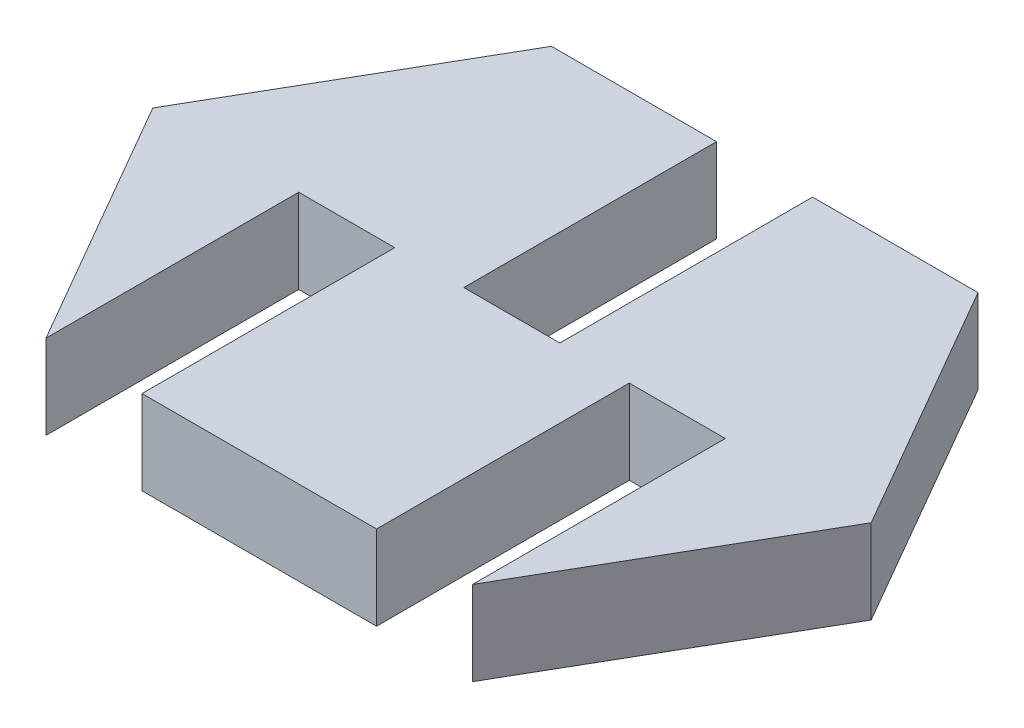
ISO-10303-21;
HEADER;
FILE_DESCRIPTION(('STEP AP214'),'2;1');
FILE_NAME('part.step','',(''),(''),'','','');
FILE_SCHEMA(('AUTOMOTIVE_DESIGN { 1 0 10303 214 1 1 1 1 }'));
ENDSEC;
DATA;
#1=APPLICATION_CONTEXT('core data for automotive mechanical design processes');
#2=APPLICATION_PROTOCOL_DEFINITION('international standard','automotive_design',2000,#1);
#3=PRODUCT_CONTEXT('',#1,'mechanical');
#4=PRODUCT('Part','Part','',(#3));
#5=PRODUCT_RELATED_PRODUCT_CATEGORY('part','',(#4));
#6=PRODUCT_DEFINITION_FORMATION('','',#4);
#7=PRODUCT_DEFINITION_CONTEXT('part definition',#1,'design');
#8=PRODUCT_DEFINITION('design','',#6,#7);
#9=PRODUCT_DEFINITION_SHAPE('','',#8);
#10=(LENGTH_UNIT() NAMED_UNIT(*) SI_UNIT(.MILLI.,.METRE.));
#11=(NAMED_UNIT(*) PLANE_ANGLE_UNIT() SI_UNIT($,.RADIAN.));
#12=(NAMED_UNIT(*) SI_UNIT($,.STERADIAN.) SOLID_ANGLE_UNIT());
#13=UNCERTAINTY_MEASURE_WITH_UNIT(LENGTH_MEASURE(1.E-05),#10,'distance_accuracy_value','');
#14=(GEOMETRIC_REPRESENTATION_CONTEXT(3) GLOBAL_UNCERTAINTY_ASSIGNED_CONTEXT((#13)) GLOBAL_UNIT_ASSIGNED_CONTEXT((#10,
#11,#12)) REPRESENTATION_CONTEXT('',''));
#15=CARTESIAN_POINT('',(0.,0.,0.));
#16=DIRECTION('',(0.,0.,1.));
#17=DIRECTION('',(1.,0.,0.));
#18=AXIS2_PLACEMENT_3D('',#15,#16,#17);
#19=CARTESIAN_POINT('',(4.2511833424019,2.5,-7.49062495930957));
#20=DIRECTION('',(0.,0.,1.));
#21=DIRECTION('',(1.,0.,0.));
#22=AXIS2_PLACEMENT_3D('',#19,#20,#21);
#23=PLANE('',#22);
#24=DIRECTION('',(-1.,0.,0.));
#25=VECTOR('',#24,1.);
#26=CARTESIAN_POINT('',(4.2511833424019,0.,-7.49062495930957));
#27=LINE('',#26,#25);
#28=CARTESIAN_POINT('',(4.2511833424019,0.,-7.49062495930957));
#29=VERTEX_POINT('',#28);
#30=CARTESIAN_POINT('',(-0.658816657598096,0.,-7.49062495930957));
#31=VERTEX_POINT('',#30);
#32=EDGE_CURVE('E279',#29,#31,#27,.T.);
#33=ORIENTED_EDGE('',*,*,#32,.T.);
#34=DIRECTION('',(0.,-1.,0.));
#35=VECTOR('',#34,1.);
#36=CARTESIAN_POINT('',(-0.658816657598096,2.5,-7.49062495930957));
#37=LINE('',#36,#35);
#38=CARTESIAN_POINT('',(-0.658816657598096,2.5,-7.49062495930957));
#39=VERTEX_POINT('',#38);
#40=EDGE_CURVE('E317',#39,#31,#37,.T.);
#41=ORIENTED_EDGE('',*,*,#40,.F.);
#42=DIRECTION('',(-1.,0.,0.));
#43=VECTOR('',#42,1.);
#44=CARTESIAN_POINT('',(4.2511833424019,2.5,-7.49062495930957));
#45=LINE('',#44,#43);
#46=CARTESIAN_POINT('',(4.2511833424019,2.5,-7.49062495930957));
#47=VERTEX_POINT('',#46);
#48=EDGE_CURVE('E257',#47,#39,#45,.T.);
#49=ORIENTED_EDGE('',*,*,#48,.F.);
#50=DIRECTION('',(0.,-1.,0.));
#51=VECTOR('',#50,1.);
#52=CARTESIAN_POINT('',(4.2511833424019,2.5,-7.49062495930957));
#53=LINE('',#52,#51);
#54=EDGE_CURVE('E48',#47,#29,#53,.T.);
#55=ORIENTED_EDGE('',*,*,#54,.T.);
#56=EDGE_LOOP('',(#33,#41,#49,#55));
#57=FACE_BOUND('',#56,.T.);
#58=ADVANCED_FACE('F39',(#57),#23,.F.);
#59=CARTESIAN_POINT('',(4.25118334240191,2.5,7.50937504069043));
#60=DIRECTION('',(-0.866025403784438,0.,-0.5));
#61=DIRECTION('',(-0.5,0.,0.866025403784438));
#62=AXIS2_PLACEMENT_3D('',#59,#60,#61);
#63=PLANE('',#62);
#64=DIRECTION('',(0.5,0.,-0.866025403784438));
#65=VECTOR('',#64,1.);
#66=CARTESIAN_POINT('',(4.25118334240191,0.,7.50937504069043));
#67=LINE('',#66,#65);
#68=CARTESIAN_POINT('',(4.25118334240191,0.,7.50937504069043));
#69=VERTEX_POINT('',#68);
#70=CARTESIAN_POINT('',(8.58131036132411,0.,0.00937504069043324));
#71=VERTEX_POINT('',#70);
#72=EDGE_CURVE('E237',#69,#71,#67,.T.);
#73=ORIENTED_EDGE('',*,*,#72,.T.);
#74=DIRECTION('',(0.,-1.,0.));
#75=VECTOR('',#74,1.);
#76=CARTESIAN_POINT('',(8.58131036132411,2.5,0.00937504069043324));
#77=LINE('',#76,#75);
#78=CARTESIAN_POINT('',(8.58131036132411,2.5,0.00937504069043324));
#79=VERTEX_POINT('',#78);
#80=EDGE_CURVE('E11',#79,#71,#77,.T.);
#81=ORIENTED_EDGE('',*,*,#80,.F.);
#82=DIRECTION('',(0.5,0.,-0.866025403784438));
#83=VECTOR('',#82,1.);
#84=CARTESIAN_POINT('',(4.25118334240191,2.5,7.50937504069043));
#85=LINE('',#84,#83);
#86=CARTESIAN_POINT('',(4.25118334240191,2.5,7.50937504069043));
#87=VERTEX_POINT('',#86);
#88=EDGE_CURVE('E248',#87,#79,#85,.T.);
#89=ORIENTED_EDGE('',*,*,#88,.F.);
#90=DIRECTION('',(0.,-1.,0.));
#91=VECTOR('',#90,1.);
#92=CARTESIAN_POINT('',(4.25118334240191,2.5,7.50937504069043));
#93=LINE('',#92,#91);
#94=EDGE_CURVE('E272',#87,#69,#93,.T.);
#95=ORIENTED_EDGE('',*,*,#94,.T.);
#96=EDGE_LOOP('',(#73,#81,#89,#95));
#97=FACE_BOUND('',#96,.T.);
#98=ADVANCED_FACE('F41',(#97),#63,.F.);
#99=CARTESIAN_POINT('',(8.58131036132411,2.5,0.00937504069043324));
#100=DIRECTION('',(-0.866025403784438,0.,0.5));
#101=DIRECTION('',(0.5,0.,0.866025403784438));
#102=AXIS2_PLACEMENT_3D('',#99,#100,#101);
#103=PLANE('',#102);
#104=DIRECTION('',(-0.5,0.,-0.866025403784438));
#105=VECTOR('',#104,1.);
#106=CARTESIAN_POINT('',(8.58131036132411,0.,0.00937504069043324));
#107=LINE('',#106,#105);
#108=EDGE_CURVE('E276',#71,#29,#107,.T.);
#109=ORIENTED_EDGE('',*,*,#108,.T.);
#110=ORIENTED_EDGE('',*,*,#54,.F.);
#111=DIRECTION('',(-0.5,0.,-0.866025403784438));
#112=VECTOR('',#111,1.);
#113=CARTESIAN_POINT('',(8.58131036132411,2.5,0.00937504069043324));
#114=LINE('',#113,#112);
#115=EDGE_CURVE('E252',#79,#47,#114,.T.);
#116=ORIENTED_EDGE('',*,*,#115,.F.);
#117=ORIENTED_EDGE('',*,*,#80,.T.);
#118=EDGE_LOOP('',(#109,#110,#116,#117));
#119=FACE_BOUND('',#118,.T.);
#120=ADVANCED_FACE('F371',(#119),#103,.F.);
#121=CARTESIAN_POINT('',(-3.5088166575981,2.5,-7.49062495930957));
#122=VERTEX_POINT('',#121);
#123=CARTESIAN_POINT('',(-8.40907069544247,2.5,-7.49062495930957));
#124=VERTEX_POINT('',#123);
#125=EDGE_CURVE('E256',#122,#124,#45,.T.);
#126=ORIENTED_EDGE('',*,*,#125,.F.);
#127=DIRECTION('',(0.,1.,0.));
#128=VECTOR('',#127,1.);
#129=CARTESIAN_POINT('',(-3.5088166575981,2.5,-7.49062495930957));
#130=LINE('',#129,#128);
#131=CARTESIAN_POINT('',(-3.5088166575981,0.,-7.49062495930957));
#132=VERTEX_POINT('',#131);
#133=EDGE_CURVE('E320',#132,#122,#130,.T.);
#134=ORIENTED_EDGE('',*,*,#133,.F.);
#135=CARTESIAN_POINT('',(-8.40907069544247,0.,-7.49062495930957));
#136=VERTEX_POINT('',#135);
#137=EDGE_CURVE('E175',#132,#136,#27,.T.);
#138=ORIENTED_EDGE('',*,*,#137,.T.);
#139=DIRECTION('',(0.,-1.,0.));
#140=VECTOR('',#139,1.);
#141=CARTESIAN_POINT('',(-8.40907069544247,2.5,-7.49062495930957));
#142=LINE('',#141,#140);
#143=EDGE_CURVE('E303',#124,#136,#142,.T.);
#144=ORIENTED_EDGE('',*,*,#143,.F.);
#145=EDGE_LOOP('',(#126,#134,#138,#144));
#146=FACE_BOUND('',#145,.T.);
#147=ADVANCED_FACE('F335',(#146),#23,.F.);
#148=CARTESIAN_POINT('',(-8.40907069544247,2.5,-7.49062495930957));
#149=DIRECTION('',(0.866025403784439,0.,0.5));
#150=DIRECTION('',(0.5,0.,-0.866025403784439));
#151=AXIS2_PLACEMENT_3D('',#148,#149,#150);
#152=PLANE('',#151);
#153=DIRECTION('',(-0.5,0.,0.866025403784439));
#154=VECTOR('',#153,1.);
#155=CARTESIAN_POINT('',(-8.40907069544247,0.,-7.49062495930957));
#156=LINE('',#155,#154);
#157=CARTESIAN_POINT('',(-12.7391977143647,0.,0.00937504069042916));
#158=VERTEX_POINT('',#157);
#159=EDGE_CURVE('E283',#136,#158,#156,.T.);
#160=ORIENTED_EDGE('',*,*,#159,.T.);
#161=DIRECTION('',(0.,-1.,0.));
#162=VECTOR('',#161,1.);
#163=CARTESIAN_POINT('',(-12.7391977143647,2.5,0.00937504069042916));
#164=LINE('',#163,#162);
#165=CARTESIAN_POINT('',(-12.7391977143647,2.5,0.00937504069042916));
#166=VERTEX_POINT('',#165);
#167=EDGE_CURVE('E299',#166,#158,#164,.T.);
#168=ORIENTED_EDGE('',*,*,#167,.F.);
#169=DIRECTION('',(-0.5,0.,0.866025403784439));
#170=VECTOR('',#169,1.);
#171=CARTESIAN_POINT('',(-8.40907069544247,2.5,-7.49062495930957));
#172=LINE('',#171,#170);
#173=EDGE_CURVE('E261',#124,#166,#172,.T.);
#174=ORIENTED_EDGE('',*,*,#173,.F.);
#175=ORIENTED_EDGE('',*,*,#143,.T.);
#176=EDGE_LOOP('',(#160,#168,#174,#175));
#177=FACE_BOUND('',#176,.T.);
#178=ADVANCED_FACE('F337',(#177),#152,.F.);
#179=CARTESIAN_POINT('',(-12.7391977143647,2.5,0.00937504069042916));
#180=DIRECTION('',(0.866025403784439,0.,-0.5));
#181=DIRECTION('',(-0.5,0.,-0.866025403784439));
#182=AXIS2_PLACEMENT_3D('',#179,#180,#181);
#183=PLANE('',#182);
#184=DIRECTION('',(0.5,0.,0.866025403784439));
#185=VECTOR('',#184,1.);
#186=CARTESIAN_POINT('',(-12.7391977143647,0.,0.00937504069042916));
#187=LINE('',#186,#185);
#188=CARTESIAN_POINT('',(-8.40907069544247,0.,7.50937504069043));
#189=VERTEX_POINT('',#188);
#190=EDGE_CURVE('E286',#158,#189,#187,.T.);
#191=ORIENTED_EDGE('',*,*,#190,.T.);
#192=DIRECTION('',(0.,-1.,0.));
#193=VECTOR('',#192,1.);
#194=CARTESIAN_POINT('',(-8.40907069544247,2.5,7.50937504069043));
#195=LINE('',#194,#193);
#196=CARTESIAN_POINT('',(-8.40907069544247,2.5,7.50937504069043));
#197=VERTEX_POINT('',#196);
#198=EDGE_CURVE('E296',#197,#189,#195,.T.);
#199=ORIENTED_EDGE('',*,*,#198,.F.);
#200=DIRECTION('',(0.5,0.,0.866025403784439));
#201=VECTOR('',#200,1.);
#202=CARTESIAN_POINT('',(-12.7391977143647,2.5,0.00937504069042916));
#203=LINE('',#202,#201);
#204=EDGE_CURVE('E264',#166,#197,#203,.T.);
#205=ORIENTED_EDGE('',*,*,#204,.F.);
#206=ORIENTED_EDGE('',*,*,#167,.T.);
#207=EDGE_LOOP('',(#191,#199,#205,#206));
#208=FACE_BOUND('',#207,.T.);
#209=ADVANCED_FACE('F342',(#208),#183,.F.);
#210=CARTESIAN_POINT('',(-8.40907069544247,2.5,7.50937504069043));
#211=DIRECTION('',(0.,0.,-1.));
#212=DIRECTION('',(-1.,0.,0.));
#213=AXIS2_PLACEMENT_3D('',#210,#211,#212);
#214=PLANE('',#213);
#215=DIRECTION('',(1.,0.,0.));
#216=VECTOR('',#215,1.);
#217=CARTESIAN_POINT('',(-8.40907069544247,0.,7.50937504069043));
#218=LINE('',#217,#216);
#219=CARTESIAN_POINT('',(-5.55907069544248,0.,7.50937504069043));
#220=VERTEX_POINT('',#219);
#221=CARTESIAN_POINT('',(1.40118334240191,0.,7.50937504069043));
#222=VERTEX_POINT('',#221);
#223=EDGE_CURVE('E253',#220,#222,#218,.T.);
#224=ORIENTED_EDGE('',*,*,#223,.T.);
#225=DIRECTION('',(0.,-1.,0.));
#226=VECTOR('',#225,1.);
#227=CARTESIAN_POINT('',(1.40118334240191,0.,7.50937504069043));
#228=LINE('',#227,#226);
#229=CARTESIAN_POINT('',(1.40118334240191,2.5,7.50937504069043));
#230=VERTEX_POINT('',#229);
#231=EDGE_CURVE('E191',#230,#222,#228,.T.);
#232=ORIENTED_EDGE('',*,*,#231,.F.);
#233=DIRECTION('',(1.,0.,0.));
#234=VECTOR('',#233,1.);
#235=CARTESIAN_POINT('',(-8.40907069544247,2.5,7.50937504069043));
#236=LINE('',#235,#234);
#237=CARTESIAN_POINT('',(-5.55907069544248,2.5,7.50937504069043));
#238=VERTEX_POINT('',#237);
#239=EDGE_CURVE('E268',#238,#230,#236,.T.);
#240=ORIENTED_EDGE('',*,*,#239,.F.);
#241=DIRECTION('',(0.,1.,0.));
#242=VECTOR('',#241,1.);
#243=CARTESIAN_POINT('',(-5.55907069544248,0.,7.50937504069043));
#244=LINE('',#243,#242);
#245=EDGE_CURVE('E205',#220,#238,#244,.T.);
#246=ORIENTED_EDGE('',*,*,#245,.F.);
#247=EDGE_LOOP('',(#224,#232,#240,#246));
#248=FACE_BOUND('',#247,.T.);
#249=ADVANCED_FACE('F359',(#248),#214,.F.);
#250=CARTESIAN_POINT('',(0.,2.5,0.));
#251=DIRECTION('',(0.,1.,0.));
#252=DIRECTION('',(0.,0.,1.));
#253=AXIS2_PLACEMENT_3D('',#250,#251,#252);
#254=PLANE('',#253);
#255=DIRECTION('',(0.,0.,-1.));
#256=VECTOR('',#255,1.);
#257=CARTESIAN_POINT('',(-0.658816657598096,2.5,0.00937504069042742));
#258=LINE('',#257,#256);
#259=CARTESIAN_POINT('',(-0.658816657598096,2.5,0.00937504069042742));
#260=VERTEX_POINT('',#259);
#261=EDGE_CURVE('E181',#260,#39,#258,.T.);
#262=ORIENTED_EDGE('',*,*,#261,.F.);
#263=DIRECTION('',(1.,0.,0.));
#264=VECTOR('',#263,1.);
#265=CARTESIAN_POINT('',(-0.658816657598096,2.5,0.00937504069042742));
#266=LINE('',#265,#264);
#267=CARTESIAN_POINT('',(-3.5088166575981,2.5,0.00937504069042742));
#268=VERTEX_POINT('',#267);
#269=EDGE_CURVE('E163',#268,#260,#266,.T.);
#270=ORIENTED_EDGE('',*,*,#269,.F.);
#271=DIRECTION('',(0.,0.,-1.));
#272=VECTOR('',#271,1.);
#273=CARTESIAN_POINT('',(-3.5088166575981,2.5,0.00937504069042742));
#274=LINE('',#273,#272);
#275=EDGE_CURVE('E160',#268,#122,#274,.T.);
#276=ORIENTED_EDGE('',*,*,#275,.T.);
#277=ORIENTED_EDGE('',*,*,#125,.T.);
#278=ORIENTED_EDGE('',*,*,#173,.T.);
#279=ORIENTED_EDGE('',*,*,#204,.T.);
#280=DIRECTION('',(0.,0.,1.));
#281=VECTOR('',#280,1.);
#282=CARTESIAN_POINT('',(-8.40907069544247,2.5,0.00937504069042829));
#283=LINE('',#282,#281);
#284=CARTESIAN_POINT('',(-8.40907069544247,2.5,0.00937504069042829));
#285=VERTEX_POINT('',#284);
#286=EDGE_CURVE('E234',#285,#197,#283,.T.);
#287=ORIENTED_EDGE('',*,*,#286,.F.);
#288=DIRECTION('',(-1.,0.,0.));
#289=VECTOR('',#288,1.);
#290=CARTESIAN_POINT('',(-8.40907069544247,2.5,0.00937504069042829));
#291=LINE('',#290,#289);
#292=CARTESIAN_POINT('',(-5.55907069544248,2.5,0.00937504069042829));
#293=VERTEX_POINT('',#292);
#294=EDGE_CURVE('E227',#293,#285,#291,.T.);
#295=ORIENTED_EDGE('',*,*,#294,.F.);
#296=DIRECTION('',(0.,0.,1.));
#297=VECTOR('',#296,1.);
#298=CARTESIAN_POINT('',(-5.55907069544248,2.5,0.00937504069042829));
#299=LINE('',#298,#297);
#300=EDGE_CURVE('E238',#293,#238,#299,.T.);
#301=ORIENTED_EDGE('',*,*,#300,.T.);
#302=ORIENTED_EDGE('',*,*,#239,.T.);
#303=DIRECTION('',(0.,0.,1.));
#304=VECTOR('',#303,1.);
#305=CARTESIAN_POINT('',(1.40118334240191,2.5,0.00937504069042829));
#306=LINE('',#305,#304);
#307=CARTESIAN_POINT('',(1.40118334240191,2.5,0.00937504069042829));
#308=VERTEX_POINT('',#307);
#309=EDGE_CURVE('E210',#308,#230,#306,.T.);
#310=ORIENTED_EDGE('',*,*,#309,.F.);
#311=DIRECTION('',(-1.,0.,0.));
#312=VECTOR('',#311,1.);
#313=CARTESIAN_POINT('',(4.25118334240191,2.5,0.00937504069042829));
#314=LINE('',#313,#312);
#315=CARTESIAN_POINT('',(4.25118334240191,2.5,0.00937504069042829));
#316=VERTEX_POINT('',#315);
#317=EDGE_CURVE('E190',#316,#308,#314,.T.);
#318=ORIENTED_EDGE('',*,*,#317,.F.);
#319=DIRECTION('',(0.,0.,1.));
#320=VECTOR('',#319,1.);
#321=CARTESIAN_POINT('',(4.25118334240191,2.5,0.00937504069042829));
#322=LINE('',#321,#320);
#323=EDGE_CURVE('E199',#316,#87,#322,.T.);
#324=ORIENTED_EDGE('',*,*,#323,.T.);
#325=ORIENTED_EDGE('',*,*,#88,.T.);
#326=ORIENTED_EDGE('',*,*,#115,.T.);
#327=ORIENTED_EDGE('',*,*,#48,.T.);
#328=EDGE_LOOP('',(#262,#270,#276,#277,#278,#279,#287,#295,#301,#302,#310,#318,#324,#325,#326,#327));
#329=FACE_BOUND('',#328,.T.);
#330=ADVANCED_FACE('F331',(#329),#254,.T.);
#331=CARTESIAN_POINT('',(0.,0.,0.));
#332=DIRECTION('',(0.,1.,0.));
#333=DIRECTION('',(0.,0.,1.));
#334=AXIS2_PLACEMENT_3D('',#331,#332,#333);
#335=PLANE('',#334);
#336=DIRECTION('',(-1.,0.,0.));
#337=VECTOR('',#336,1.);
#338=CARTESIAN_POINT('',(-0.658816657598096,0.,0.00937504069042742));
#339=LINE('',#338,#337);
#340=CARTESIAN_POINT('',(-0.658816657598096,0.,0.00937504069042742));
#341=VERTEX_POINT('',#340);
#342=CARTESIAN_POINT('',(-3.5088166575981,0.,0.00937504069042742));
#343=VERTEX_POINT('',#342);
#344=EDGE_CURVE('E164',#341,#343,#339,.T.);
#345=ORIENTED_EDGE('',*,*,#344,.F.);
#346=DIRECTION('',(0.,0.,-1.));
#347=VECTOR('',#346,1.);
#348=CARTESIAN_POINT('',(-0.658816657598096,0.,0.00937504069042742));
#349=LINE('',#348,#347);
#350=EDGE_CURVE('E177',#341,#31,#349,.T.);
#351=ORIENTED_EDGE('',*,*,#350,.T.);
#352=ORIENTED_EDGE('',*,*,#32,.F.);
#353=ORIENTED_EDGE('',*,*,#108,.F.);
#354=ORIENTED_EDGE('',*,*,#72,.F.);
#355=DIRECTION('',(0.,0.,1.));
#356=VECTOR('',#355,1.);
#357=CARTESIAN_POINT('',(4.25118334240191,0.,0.00937504069042829));
#358=LINE('',#357,#356);
#359=CARTESIAN_POINT('',(4.25118334240191,0.,0.00937504069042829));
#360=VERTEX_POINT('',#359);
#361=EDGE_CURVE('E202',#360,#69,#358,.T.);
#362=ORIENTED_EDGE('',*,*,#361,.F.);
#363=DIRECTION('',(1.,0.,0.));
#364=VECTOR('',#363,1.);
#365=CARTESIAN_POINT('',(4.25118334240191,0.,0.00937504069042829));
#366=LINE('',#365,#364);
#367=CARTESIAN_POINT('',(1.40118334240191,0.,0.00937504069042829));
#368=VERTEX_POINT('',#367);
#369=EDGE_CURVE('E196',#368,#360,#366,.T.);
#370=ORIENTED_EDGE('',*,*,#369,.F.);
#371=DIRECTION('',(0.,0.,1.));
#372=VECTOR('',#371,1.);
#373=CARTESIAN_POINT('',(1.40118334240191,0.,0.00937504069042829));
#374=LINE('',#373,#372);
#375=EDGE_CURVE('E206',#368,#222,#374,.T.);
#376=ORIENTED_EDGE('',*,*,#375,.T.);
#377=ORIENTED_EDGE('',*,*,#223,.F.);
#378=DIRECTION('',(0.,0.,1.));
#379=VECTOR('',#378,1.);
#380=CARTESIAN_POINT('',(-5.55907069544248,0.,0.00937504069042829));
#381=LINE('',#380,#379);
#382=CARTESIAN_POINT('',(-5.55907069544248,0.,0.00937504069042829));
#383=VERTEX_POINT('',#382);
#384=EDGE_CURVE('E242',#383,#220,#381,.T.);
#385=ORIENTED_EDGE('',*,*,#384,.F.);
#386=DIRECTION('',(1.,0.,0.));
#387=VECTOR('',#386,1.);
#388=CARTESIAN_POINT('',(-8.40907069544247,0.,0.00937504069042829));
#389=LINE('',#388,#387);
#390=CARTESIAN_POINT('',(-8.40907069544247,0.,0.00937504069042829));
#391=VERTEX_POINT('',#390);
#392=EDGE_CURVE('E219',#391,#383,#389,.T.);
#393=ORIENTED_EDGE('',*,*,#392,.F.);
#394=DIRECTION('',(0.,0.,1.));
#395=VECTOR('',#394,1.);
#396=CARTESIAN_POINT('',(-8.40907069544247,0.,0.00937504069042829));
#397=LINE('',#396,#395);
#398=EDGE_CURVE('E231',#391,#189,#397,.T.);
#399=ORIENTED_EDGE('',*,*,#398,.T.);
#400=ORIENTED_EDGE('',*,*,#190,.F.);
#401=ORIENTED_EDGE('',*,*,#159,.F.);
#402=ORIENTED_EDGE('',*,*,#137,.F.);
#403=DIRECTION('',(0.,0.,-1.));
#404=VECTOR('',#403,1.);
#405=CARTESIAN_POINT('',(-3.5088166575981,0.,0.00937504069042742));
#406=LINE('',#405,#404);
#407=EDGE_CURVE('E157',#343,#132,#406,.T.);
#408=ORIENTED_EDGE('',*,*,#407,.F.);
#409=EDGE_LOOP('',(#345,#351,#352,#353,#354,#362,#370,#376,#377,#385,#393,#399,#400,#401,#402,#408));
#410=FACE_BOUND('',#409,.T.);
#411=ADVANCED_FACE('F173',(#410),#335,.F.);
#412=CARTESIAN_POINT('',(-8.40907069544247,0.,0.00937504069042829));
#413=DIRECTION('',(-1.,0.,0.));
#414=DIRECTION('',(0.,0.,1.));
#415=AXIS2_PLACEMENT_3D('',#412,#413,#414);
#416=PLANE('',#415);
#417=ORIENTED_EDGE('',*,*,#198,.T.);
#418=ORIENTED_EDGE('',*,*,#398,.F.);
#419=DIRECTION('',(0.,-1.,0.));
#420=VECTOR('',#419,1.);
#421=CARTESIAN_POINT('',(-8.40907069544247,0.,0.00937504069042829));
#422=LINE('',#421,#420);
#423=EDGE_CURVE('E216',#285,#391,#422,.T.);
#424=ORIENTED_EDGE('',*,*,#423,.F.);
#425=ORIENTED_EDGE('',*,*,#286,.T.);
#426=EDGE_LOOP('',(#417,#418,#424,#425));
#427=FACE_BOUND('',#426,.T.);
#428=ADVANCED_FACE('F346',(#427),#416,.F.);
#429=CARTESIAN_POINT('',(-5.55907069544248,0.,0.00937504069042829));
#430=DIRECTION('',(1.,0.,0.));
#431=DIRECTION('',(0.,0.,-1.));
#432=AXIS2_PLACEMENT_3D('',#429,#430,#431);
#433=PLANE('',#432);
#434=ORIENTED_EDGE('',*,*,#245,.T.);
#435=ORIENTED_EDGE('',*,*,#300,.F.);
#436=DIRECTION('',(0.,1.,0.));
#437=VECTOR('',#436,1.);
#438=CARTESIAN_POINT('',(-5.55907069544248,0.,0.00937504069042829));
#439=LINE('',#438,#437);
#440=EDGE_CURVE('E223',#383,#293,#439,.T.);
#441=ORIENTED_EDGE('',*,*,#440,.F.);
#442=ORIENTED_EDGE('',*,*,#384,.T.);
#443=EDGE_LOOP('',(#434,#435,#441,#442));
#444=FACE_BOUND('',#443,.T.);
#445=ADVANCED_FACE('F353',(#444),#433,.F.);
#446=CARTESIAN_POINT('',(0.,0.,0.00937504069042829));
#447=DIRECTION('',(0.,0.,-1.));
#448=DIRECTION('',(-1.,0.,0.));
#449=AXIS2_PLACEMENT_3D('',#446,#447,#448);
#450=PLANE('',#449);
#451=ORIENTED_EDGE('',*,*,#423,.T.);
#452=ORIENTED_EDGE('',*,*,#392,.T.);
#453=ORIENTED_EDGE('',*,*,#440,.T.);
#454=ORIENTED_EDGE('',*,*,#294,.T.);
#455=EDGE_LOOP('',(#451,#452,#453,#454));
#456=FACE_BOUND('',#455,.T.);
#457=ADVANCED_FACE('F350',(#456),#450,.F.);
#458=CARTESIAN_POINT('',(4.25118334240191,0.,0.00937504069042829));
#459=DIRECTION('',(1.,0.,0.));
#460=DIRECTION('',(0.,0.,-1.));
#461=AXIS2_PLACEMENT_3D('',#458,#459,#460);
#462=PLANE('',#461);
#463=ORIENTED_EDGE('',*,*,#94,.F.);
#464=ORIENTED_EDGE('',*,*,#323,.F.);
#465=DIRECTION('',(0.,1.,0.));
#466=VECTOR('',#465,1.);
#467=CARTESIAN_POINT('',(4.25118334240191,0.,0.00937504069042829));
#468=LINE('',#467,#466);
#469=EDGE_CURVE('E186',#360,#316,#468,.T.);
#470=ORIENTED_EDGE('',*,*,#469,.F.);
#471=ORIENTED_EDGE('',*,*,#361,.T.);
#472=EDGE_LOOP('',(#463,#464,#470,#471));
#473=FACE_BOUND('',#472,.T.);
#474=ADVANCED_FACE('F401',(#473),#462,.F.);
#475=CARTESIAN_POINT('',(1.40118334240191,0.,0.00937504069042829));
#476=DIRECTION('',(-1.,0.,0.));
#477=DIRECTION('',(0.,0.,1.));
#478=AXIS2_PLACEMENT_3D('',#475,#476,#477);
#479=PLANE('',#478);
#480=ORIENTED_EDGE('',*,*,#231,.T.);
#481=ORIENTED_EDGE('',*,*,#375,.F.);
#482=DIRECTION('',(0.,-1.,0.));
#483=VECTOR('',#482,1.);
#484=CARTESIAN_POINT('',(1.40118334240191,0.,0.00937504069042829));
#485=LINE('',#484,#483);
#486=EDGE_CURVE('E63',#308,#368,#485,.T.);
#487=ORIENTED_EDGE('',*,*,#486,.F.);
#488=ORIENTED_EDGE('',*,*,#309,.T.);
#489=EDGE_LOOP('',(#480,#481,#487,#488));
#490=FACE_BOUND('',#489,.T.);
#491=ADVANCED_FACE('F362',(#490),#479,.F.);
#492=CARTESIAN_POINT('',(0.,0.,0.00937504069042829));
#493=DIRECTION('',(0.,0.,1.));
#494=DIRECTION('',(1.,0.,0.));
#495=AXIS2_PLACEMENT_3D('',#492,#493,#494);
#496=PLANE('',#495);
#497=ORIENTED_EDGE('',*,*,#469,.T.);
#498=ORIENTED_EDGE('',*,*,#317,.T.);
#499=ORIENTED_EDGE('',*,*,#486,.T.);
#500=ORIENTED_EDGE('',*,*,#369,.T.);
#501=EDGE_LOOP('',(#497,#498,#499,#500));
#502=FACE_BOUND('',#501,.T.);
#503=ADVANCED_FACE('F365',(#502),#496,.T.);
#504=CARTESIAN_POINT('',(-0.658816657598096,2.5,0.00937504069042742));
#505=DIRECTION('',(1.,0.,0.));
#506=DIRECTION('',(0.,1.,0.));
#507=AXIS2_PLACEMENT_3D('',#504,#505,#506);
#508=PLANE('',#507);
#509=ORIENTED_EDGE('',*,*,#40,.T.);
#510=ORIENTED_EDGE('',*,*,#350,.F.);
#511=DIRECTION('',(0.,-1.,0.));
#512=VECTOR('',#511,1.);
#513=CARTESIAN_POINT('',(-0.658816657598096,2.5,0.00937504069042742));
#514=LINE('',#513,#512);
#515=EDGE_CURVE('E55',#260,#341,#514,.T.);
#516=ORIENTED_EDGE('',*,*,#515,.F.);
#517=ORIENTED_EDGE('',*,*,#261,.T.);
#518=EDGE_LOOP('',(#509,#510,#516,#517));
#519=FACE_BOUND('',#518,.T.);
#520=ADVANCED_FACE('F316',(#519),#508,.F.);
#521=CARTESIAN_POINT('',(-3.5088166575981,2.5,0.00937504069042742));
#522=DIRECTION('',(-1.,0.,0.));
#523=DIRECTION('',(0.,0.,1.));
#524=AXIS2_PLACEMENT_3D('',#521,#522,#523);
#525=PLANE('',#524);
#526=ORIENTED_EDGE('',*,*,#133,.T.);
#527=ORIENTED_EDGE('',*,*,#275,.F.);
#528=DIRECTION('',(0.,1.,0.));
#529=VECTOR('',#528,1.);
#530=CARTESIAN_POINT('',(-3.5088166575981,2.5,0.00937504069042742));
#531=LINE('',#530,#529);
#532=EDGE_CURVE('E154',#343,#268,#531,.T.);
#533=ORIENTED_EDGE('',*,*,#532,.F.);
#534=ORIENTED_EDGE('',*,*,#407,.T.);
#535=EDGE_LOOP('',(#526,#527,#533,#534));
#536=FACE_BOUND('',#535,.T.);
#537=ADVANCED_FACE('F155',(#536),#525,.F.);
#538=CARTESIAN_POINT('',(0.,0.,0.00937504069042742));
#539=DIRECTION('',(0.,0.,-1.));
#540=DIRECTION('',(-1.,0.,0.));
#541=AXIS2_PLACEMENT_3D('',#538,#539,#540);
#542=PLANE('',#541);
#543=ORIENTED_EDGE('',*,*,#515,.T.);
#544=ORIENTED_EDGE('',*,*,#344,.T.);
#545=ORIENTED_EDGE('',*,*,#532,.T.);
#546=ORIENTED_EDGE('',*,*,#269,.T.);
#547=EDGE_LOOP('',(#543,#544,#545,#546));
#548=FACE_BOUND('',#547,.T.);
#549=ADVANCED_FACE('F167',(#548),#542,.T.);
#550=CLOSED_SHELL('',(#58,#98,#120,#147,#178,#209,#249,#330,#411,#428,#445,#457,#474,#491,#503,
#520,#537,#549));
#551=MANIFOLD_SOLID_BREP('B2',#550);
#552=ADVANCED_BREP_SHAPE_REPRESENTATION('',(#18,#551),#14);
#553=SHAPE_DEFINITION_REPRESENTATION(#9,#552);
ENDSEC;
END-ISO-10303-21;
